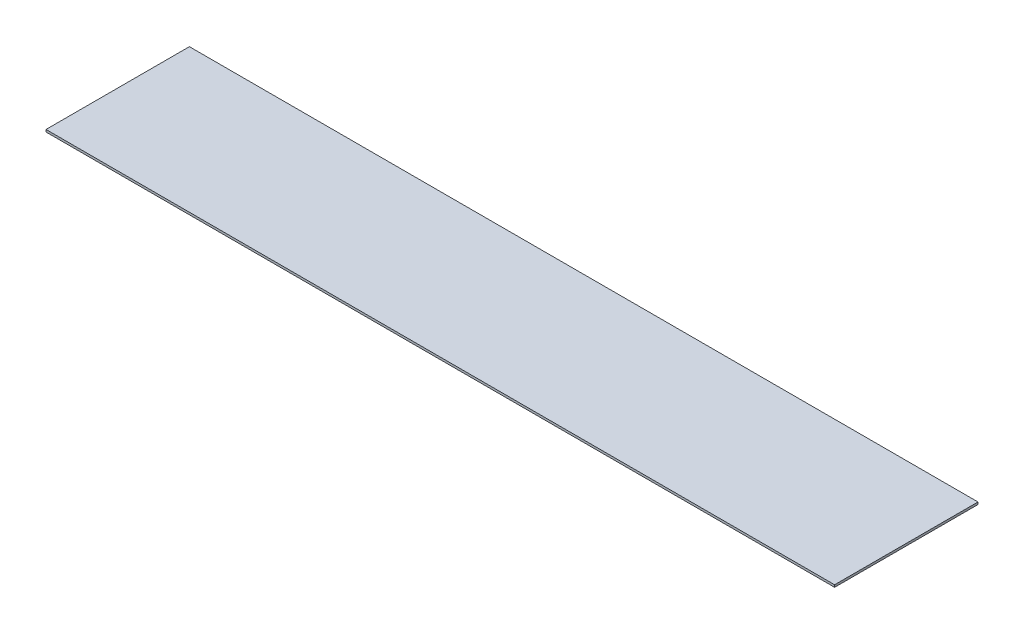
ISO-10303-21;
HEADER;
FILE_DESCRIPTION(('STEP AP214'),'2;1');
FILE_NAME('part.step','',(''),(''),'','','');
FILE_SCHEMA(('AUTOMOTIVE_DESIGN { 1 0 10303 214 1 1 1 1 }'));
ENDSEC;
DATA;
#1=APPLICATION_CONTEXT('core data for automotive mechanical design processes');
#2=APPLICATION_PROTOCOL_DEFINITION('international standard','automotive_design',2000,#1);
#3=PRODUCT_CONTEXT('',#1,'mechanical');
#4=PRODUCT('Part','Part','',(#3));
#5=PRODUCT_RELATED_PRODUCT_CATEGORY('part','',(#4));
#6=PRODUCT_DEFINITION_FORMATION('','',#4);
#7=PRODUCT_DEFINITION_CONTEXT('part definition',#1,'design');
#8=PRODUCT_DEFINITION('design','',#6,#7);
#9=PRODUCT_DEFINITION_SHAPE('','',#8);
#10=(LENGTH_UNIT() NAMED_UNIT(*) SI_UNIT(.MILLI.,.METRE.));
#11=(NAMED_UNIT(*) PLANE_ANGLE_UNIT() SI_UNIT($,.RADIAN.));
#12=(NAMED_UNIT(*) SI_UNIT($,.STERADIAN.) SOLID_ANGLE_UNIT());
#13=UNCERTAINTY_MEASURE_WITH_UNIT(LENGTH_MEASURE(1.E-05),#10,'distance_accuracy_value','');
#14=(GEOMETRIC_REPRESENTATION_CONTEXT(3) GLOBAL_UNCERTAINTY_ASSIGNED_CONTEXT((#13)) GLOBAL_UNIT_ASSIGNED_CONTEXT((#10,
#11,#12)) REPRESENTATION_CONTEXT('',''));
#15=CARTESIAN_POINT('',(0.,0.,0.));
#16=DIRECTION('',(0.,0.,1.));
#17=DIRECTION('',(1.,0.,0.));
#18=AXIS2_PLACEMENT_3D('',#15,#16,#17);
#19=CARTESIAN_POINT('',(0.,1.5875,0.));
#20=DIRECTION('',(1.,0.,0.));
#21=DIRECTION('',(0.,0.,-1.));
#22=AXIS2_PLACEMENT_3D('',#19,#20,#21);
#23=PLANE('',#22);
#24=DIRECTION('',(0.,0.,1.));
#25=VECTOR('',#24,1.);
#26=CARTESIAN_POINT('',(0.,0.,0.));
#27=LINE('',#26,#25);
#28=CARTESIAN_POINT('',(0.,0.,-101.6));
#29=VERTEX_POINT('',#28);
#30=CARTESIAN_POINT('',(0.,0.,0.));
#31=VERTEX_POINT('',#30);
#32=EDGE_CURVE('E96',#29,#31,#27,.T.);
#33=ORIENTED_EDGE('',*,*,#32,.T.);
#34=DIRECTION('',(0.,-1.,0.));
#35=VECTOR('',#34,1.);
#36=CARTESIAN_POINT('',(0.,1.5875,0.));
#37=LINE('',#36,#35);
#38=CARTESIAN_POINT('',(0.,1.5875,0.));
#39=VERTEX_POINT('',#38);
#40=EDGE_CURVE('E11',#39,#31,#37,.T.);
#41=ORIENTED_EDGE('',*,*,#40,.F.);
#42=DIRECTION('',(0.,0.,1.));
#43=VECTOR('',#42,1.);
#44=CARTESIAN_POINT('',(0.,1.5875,0.));
#45=LINE('',#44,#43);
#46=CARTESIAN_POINT('',(0.,1.5875,-101.6));
#47=VERTEX_POINT('',#46);
#48=EDGE_CURVE('E84',#47,#39,#45,.T.);
#49=ORIENTED_EDGE('',*,*,#48,.F.);
#50=DIRECTION('',(0.,-1.,0.));
#51=VECTOR('',#50,1.);
#52=CARTESIAN_POINT('',(0.,1.5875,-101.6));
#53=LINE('',#52,#51);
#54=EDGE_CURVE('E92',#47,#29,#53,.T.);
#55=ORIENTED_EDGE('',*,*,#54,.T.);
#56=EDGE_LOOP('',(#33,#41,#49,#55));
#57=FACE_BOUND('',#56,.T.);
#58=ADVANCED_FACE('F33',(#57),#23,.F.);
#59=CARTESIAN_POINT('',(0.,1.5875,0.));
#60=DIRECTION('',(0.,0.,-1.));
#61=DIRECTION('',(-1.,0.,0.));
#62=AXIS2_PLACEMENT_3D('',#59,#60,#61);
#63=PLANE('',#62);
#64=DIRECTION('',(1.,0.,0.));
#65=VECTOR('',#64,1.);
#66=CARTESIAN_POINT('',(0.,0.,0.));
#67=LINE('',#66,#65);
#68=CARTESIAN_POINT('',(558.8,0.,0.));
#69=VERTEX_POINT('',#68);
#70=EDGE_CURVE('E88',#31,#69,#67,.T.);
#71=ORIENTED_EDGE('',*,*,#70,.T.);
#72=DIRECTION('',(0.,-1.,0.));
#73=VECTOR('',#72,1.);
#74=CARTESIAN_POINT('',(558.8,1.5875,0.));
#75=LINE('',#74,#73);
#76=CARTESIAN_POINT('',(558.8,1.5875,0.));
#77=VERTEX_POINT('',#76);
#78=EDGE_CURVE('E41',#77,#69,#75,.T.);
#79=ORIENTED_EDGE('',*,*,#78,.F.);
#80=DIRECTION('',(1.,0.,0.));
#81=VECTOR('',#80,1.);
#82=CARTESIAN_POINT('',(0.,1.5875,0.));
#83=LINE('',#82,#81);
#84=EDGE_CURVE('E79',#39,#77,#83,.T.);
#85=ORIENTED_EDGE('',*,*,#84,.F.);
#86=ORIENTED_EDGE('',*,*,#40,.T.);
#87=EDGE_LOOP('',(#71,#79,#85,#86));
#88=FACE_BOUND('',#87,.T.);
#89=ADVANCED_FACE('F87',(#88),#63,.F.);
#90=CARTESIAN_POINT('',(558.8,1.5875,0.));
#91=DIRECTION('',(-1.,0.,0.));
#92=DIRECTION('',(0.,0.,1.));
#93=AXIS2_PLACEMENT_3D('',#90,#91,#92);
#94=PLANE('',#93);
#95=DIRECTION('',(0.,0.,-1.));
#96=VECTOR('',#95,1.);
#97=CARTESIAN_POINT('',(558.8,0.,0.));
#98=LINE('',#97,#96);
#99=CARTESIAN_POINT('',(558.8,0.,-101.6));
#100=VERTEX_POINT('',#99);
#101=EDGE_CURVE('E66',#69,#100,#98,.T.);
#102=ORIENTED_EDGE('',*,*,#101,.T.);
#103=DIRECTION('',(0.,-1.,0.));
#104=VECTOR('',#103,1.);
#105=CARTESIAN_POINT('',(558.8,1.5875,-101.6));
#106=LINE('',#105,#104);
#107=CARTESIAN_POINT('',(558.8,1.5875,-101.6));
#108=VERTEX_POINT('',#107);
#109=EDGE_CURVE('E89',#108,#100,#106,.T.);
#110=ORIENTED_EDGE('',*,*,#109,.F.);
#111=DIRECTION('',(0.,0.,-1.));
#112=VECTOR('',#111,1.);
#113=CARTESIAN_POINT('',(558.8,1.5875,0.));
#114=LINE('',#113,#112);
#115=EDGE_CURVE('E82',#77,#108,#114,.T.);
#116=ORIENTED_EDGE('',*,*,#115,.F.);
#117=ORIENTED_EDGE('',*,*,#78,.T.);
#118=EDGE_LOOP('',(#102,#110,#116,#117));
#119=FACE_BOUND('',#118,.T.);
#120=ADVANCED_FACE('F90',(#119),#94,.F.);
#121=CARTESIAN_POINT('',(0.,1.5875,-101.6));
#122=DIRECTION('',(0.,0.,1.));
#123=DIRECTION('',(1.,0.,0.));
#124=AXIS2_PLACEMENT_3D('',#121,#122,#123);
#125=PLANE('',#124);
#126=DIRECTION('',(-1.,0.,0.));
#127=VECTOR('',#126,1.);
#128=CARTESIAN_POINT('',(0.,0.,-101.6));
#129=LINE('',#128,#127);
#130=EDGE_CURVE('E72',#100,#29,#129,.T.);
#131=ORIENTED_EDGE('',*,*,#130,.T.);
#132=ORIENTED_EDGE('',*,*,#54,.F.);
#133=DIRECTION('',(-1.,0.,0.));
#134=VECTOR('',#133,1.);
#135=CARTESIAN_POINT('',(0.,1.5875,-101.6));
#136=LINE('',#135,#134);
#137=EDGE_CURVE('E49',#108,#47,#136,.T.);
#138=ORIENTED_EDGE('',*,*,#137,.F.);
#139=ORIENTED_EDGE('',*,*,#109,.T.);
#140=EDGE_LOOP('',(#131,#132,#138,#139));
#141=FACE_BOUND('',#140,.T.);
#142=ADVANCED_FACE('F103',(#141),#125,.F.);
#143=CARTESIAN_POINT('',(0.,1.5875,0.));
#144=DIRECTION('',(0.,-1.,0.));
#145=DIRECTION('',(0.,0.,-1.));
#146=AXIS2_PLACEMENT_3D('',#143,#144,#145);
#147=PLANE('',#146);
#148=ORIENTED_EDGE('',*,*,#48,.T.);
#149=ORIENTED_EDGE('',*,*,#84,.T.);
#150=ORIENTED_EDGE('',*,*,#115,.T.);
#151=ORIENTED_EDGE('',*,*,#137,.T.);
#152=EDGE_LOOP('',(#148,#149,#150,#151));
#153=FACE_BOUND('',#152,.T.);
#154=ADVANCED_FACE('F80',(#153),#147,.F.);
#155=CARTESIAN_POINT('',(0.,0.,0.));
#156=DIRECTION('',(0.,-1.,0.));
#157=DIRECTION('',(0.,0.,-1.));
#158=AXIS2_PLACEMENT_3D('',#155,#156,#157);
#159=PLANE('',#158);
#160=ORIENTED_EDGE('',*,*,#32,.F.);
#161=ORIENTED_EDGE('',*,*,#130,.F.);
#162=ORIENTED_EDGE('',*,*,#101,.F.);
#163=ORIENTED_EDGE('',*,*,#70,.F.);
#164=EDGE_LOOP('',(#160,#161,#162,#163));
#165=FACE_BOUND('',#164,.T.);
#166=ADVANCED_FACE('F106',(#165),#159,.T.);
#167=CLOSED_SHELL('',(#58,#89,#120,#142,#154,#166));
#168=MANIFOLD_SOLID_BREP('B2',#167);
#169=ADVANCED_BREP_SHAPE_REPRESENTATION('',(#18,#168),#14);
#170=SHAPE_DEFINITION_REPRESENTATION(#9,#169);
ENDSEC;
END-ISO-10303-21;
